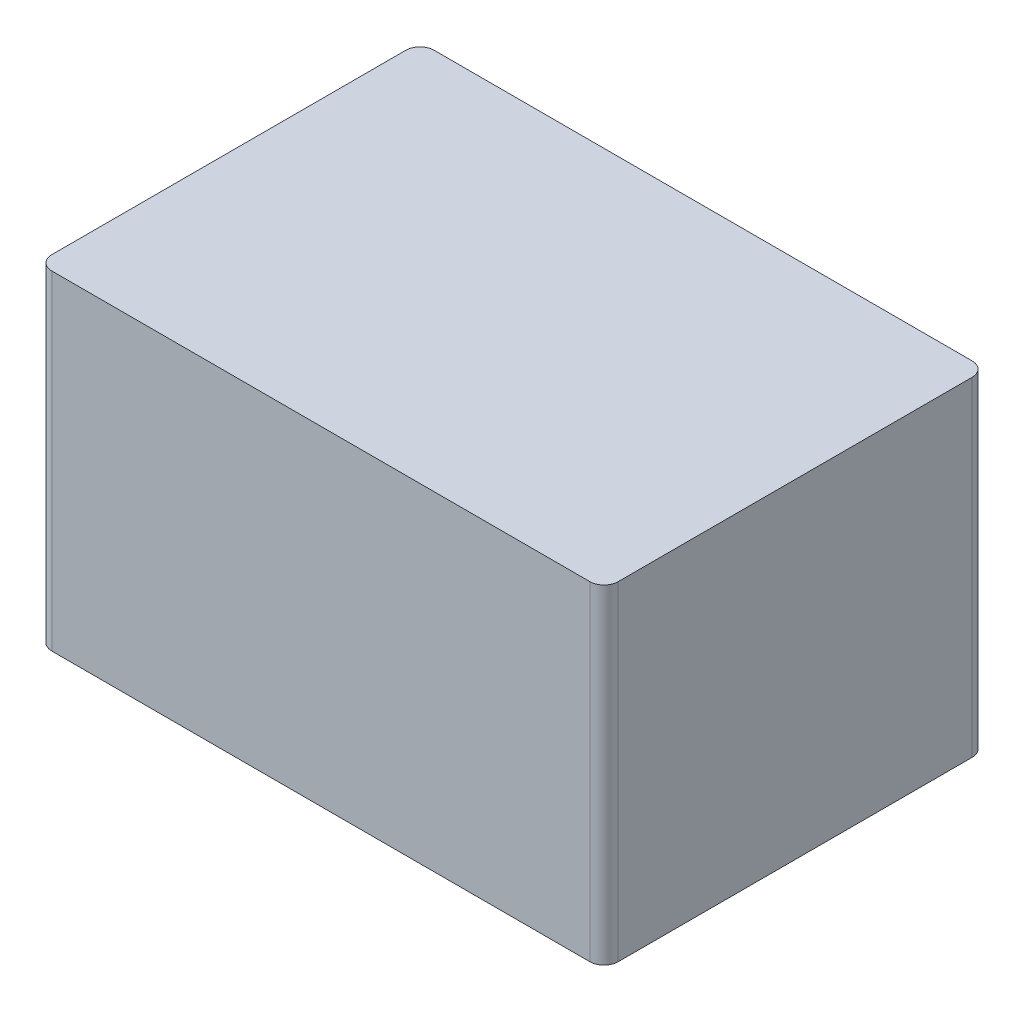
ISO-10303-21;
HEADER;
FILE_DESCRIPTION(('STEP AP214'),'2;1');
FILE_NAME('part.step','',(''),(''),'','','');
FILE_SCHEMA(('AUTOMOTIVE_DESIGN { 1 0 10303 214 1 1 1 1 }'));
ENDSEC;
DATA;
#1=APPLICATION_CONTEXT('core data for automotive mechanical design processes');
#2=APPLICATION_PROTOCOL_DEFINITION('international standard','automotive_design',2000,#1);
#3=PRODUCT_CONTEXT('',#1,'mechanical');
#4=PRODUCT('Part','Part','',(#3));
#5=PRODUCT_RELATED_PRODUCT_CATEGORY('part','',(#4));
#6=PRODUCT_DEFINITION_FORMATION('','',#4);
#7=PRODUCT_DEFINITION_CONTEXT('part definition',#1,'design');
#8=PRODUCT_DEFINITION('design','',#6,#7);
#9=PRODUCT_DEFINITION_SHAPE('','',#8);
#10=(LENGTH_UNIT() NAMED_UNIT(*) SI_UNIT(.MILLI.,.METRE.));
#11=(NAMED_UNIT(*) PLANE_ANGLE_UNIT() SI_UNIT($,.RADIAN.));
#12=(NAMED_UNIT(*) SI_UNIT($,.STERADIAN.) SOLID_ANGLE_UNIT());
#13=UNCERTAINTY_MEASURE_WITH_UNIT(LENGTH_MEASURE(1.E-05),#10,'distance_accuracy_value','');
#14=(GEOMETRIC_REPRESENTATION_CONTEXT(3) GLOBAL_UNCERTAINTY_ASSIGNED_CONTEXT((#13)) GLOBAL_UNIT_ASSIGNED_CONTEXT((#10,
#11,#12)) REPRESENTATION_CONTEXT('',''));
#15=CARTESIAN_POINT('',(0.,0.,0.));
#16=DIRECTION('',(0.,0.,1.));
#17=DIRECTION('',(1.,0.,0.));
#18=AXIS2_PLACEMENT_3D('',#15,#16,#17);
#19=CARTESIAN_POINT('',(0.,46.5,0.));
#20=DIRECTION('',(1.,0.,0.));
#21=DIRECTION('',(0.,0.,-1.));
#22=AXIS2_PLACEMENT_3D('',#19,#20,#21);
#23=PLANE('',#22);
#24=DIRECTION('',(0.,0.,1.));
#25=VECTOR('',#24,1.);
#26=CARTESIAN_POINT('',(0.,46.5,0.));
#27=LINE('',#26,#25);
#28=CARTESIAN_POINT('',(0.,46.5,-52.));
#29=VERTEX_POINT('',#28);
#30=CARTESIAN_POINT('',(0.,46.5,-2.));
#31=VERTEX_POINT('',#30);
#32=EDGE_CURVE('E117',#29,#31,#27,.T.);
#33=ORIENTED_EDGE('',*,*,#32,.F.);
#34=DIRECTION('',(0.,-1.,0.));
#35=VECTOR('',#34,1.);
#36=CARTESIAN_POINT('',(0.,46.5,-52.));
#37=LINE('',#36,#35);
#38=CARTESIAN_POINT('',(0.,0.,-52.));
#39=VERTEX_POINT('',#38);
#40=EDGE_CURVE('E102',#29,#39,#37,.T.);
#41=ORIENTED_EDGE('',*,*,#40,.T.);
#42=DIRECTION('',(0.,0.,1.));
#43=VECTOR('',#42,1.);
#44=CARTESIAN_POINT('',(0.,0.,0.));
#45=LINE('',#44,#43);
#46=CARTESIAN_POINT('',(0.,0.,-2.));
#47=VERTEX_POINT('',#46);
#48=EDGE_CURVE('E114',#39,#47,#45,.T.);
#49=ORIENTED_EDGE('',*,*,#48,.T.);
#50=DIRECTION('',(0.,-1.,0.));
#51=VECTOR('',#50,1.);
#52=CARTESIAN_POINT('',(0.,46.5,-2.));
#53=LINE('',#52,#51);
#54=EDGE_CURVE('E119',#47,#31,#53,.F.);
#55=ORIENTED_EDGE('',*,*,#54,.T.);
#56=EDGE_LOOP('',(#33,#41,#49,#55));
#57=FACE_BOUND('',#56,.T.);
#58=ADVANCED_FACE('F33',(#57),#23,.F.);
#59=CARTESIAN_POINT('',(0.,46.5,0.));
#60=DIRECTION('',(0.,0.,-1.));
#61=DIRECTION('',(-1.,0.,0.));
#62=AXIS2_PLACEMENT_3D('',#59,#60,#61);
#63=PLANE('',#62);
#64=DIRECTION('',(1.,0.,0.));
#65=VECTOR('',#64,1.);
#66=CARTESIAN_POINT('',(0.,46.5,0.));
#67=LINE('',#66,#65);
#68=CARTESIAN_POINT('',(2.,46.5,0.));
#69=VERTEX_POINT('',#68);
#70=CARTESIAN_POINT('',(78.,46.5,0.));
#71=VERTEX_POINT('',#70);
#72=EDGE_CURVE('E168',#69,#71,#67,.T.);
#73=ORIENTED_EDGE('',*,*,#72,.F.);
#74=DIRECTION('',(0.,-1.,0.));
#75=VECTOR('',#74,1.);
#76=CARTESIAN_POINT('',(2.,46.5,0.));
#77=LINE('',#76,#75);
#78=CARTESIAN_POINT('',(2.,0.,0.));
#79=VERTEX_POINT('',#78);
#80=EDGE_CURVE('E152',#69,#79,#77,.T.);
#81=ORIENTED_EDGE('',*,*,#80,.T.);
#82=DIRECTION('',(1.,0.,0.));
#83=VECTOR('',#82,1.);
#84=CARTESIAN_POINT('',(0.,0.,0.));
#85=LINE('',#84,#83);
#86=CARTESIAN_POINT('',(78.,0.,0.));
#87=VERTEX_POINT('',#86);
#88=EDGE_CURVE('E123',#79,#87,#85,.T.);
#89=ORIENTED_EDGE('',*,*,#88,.T.);
#90=DIRECTION('',(0.,-1.,0.));
#91=VECTOR('',#90,1.);
#92=CARTESIAN_POINT('',(78.,46.5,0.));
#93=LINE('',#92,#91);
#94=EDGE_CURVE('E150',#87,#71,#93,.F.);
#95=ORIENTED_EDGE('',*,*,#94,.T.);
#96=EDGE_LOOP('',(#73,#81,#89,#95));
#97=FACE_BOUND('',#96,.T.);
#98=ADVANCED_FACE('F178',(#97),#63,.F.);
#99=CARTESIAN_POINT('',(80.,46.5,0.));
#100=DIRECTION('',(-1.,0.,0.));
#101=DIRECTION('',(0.,0.,1.));
#102=AXIS2_PLACEMENT_3D('',#99,#100,#101);
#103=PLANE('',#102);
#104=DIRECTION('',(0.,0.,-1.));
#105=VECTOR('',#104,1.);
#106=CARTESIAN_POINT('',(80.,0.,0.));
#107=LINE('',#106,#105);
#108=CARTESIAN_POINT('',(80.,0.,-2.));
#109=VERTEX_POINT('',#108);
#110=CARTESIAN_POINT('',(80.,0.,-52.));
#111=VERTEX_POINT('',#110);
#112=EDGE_CURVE('E126',#109,#111,#107,.T.);
#113=ORIENTED_EDGE('',*,*,#112,.T.);
#114=DIRECTION('',(0.,-1.,0.));
#115=VECTOR('',#114,1.);
#116=CARTESIAN_POINT('',(80.,46.5,-52.));
#117=LINE('',#116,#115);
#118=CARTESIAN_POINT('',(80.,46.5,-52.));
#119=VERTEX_POINT('',#118);
#120=EDGE_CURVE('E11',#111,#119,#117,.F.);
#121=ORIENTED_EDGE('',*,*,#120,.T.);
#122=DIRECTION('',(0.,0.,-1.));
#123=VECTOR('',#122,1.);
#124=CARTESIAN_POINT('',(80.,46.5,0.));
#125=LINE('',#124,#123);
#126=CARTESIAN_POINT('',(80.,46.5,-2.));
#127=VERTEX_POINT('',#126);
#128=EDGE_CURVE('E158',#127,#119,#125,.T.);
#129=ORIENTED_EDGE('',*,*,#128,.F.);
#130=DIRECTION('',(0.,-1.,0.));
#131=VECTOR('',#130,1.);
#132=CARTESIAN_POINT('',(80.,46.5,-2.));
#133=LINE('',#132,#131);
#134=EDGE_CURVE('E41',#127,#109,#133,.T.);
#135=ORIENTED_EDGE('',*,*,#134,.T.);
#136=EDGE_LOOP('',(#113,#121,#129,#135));
#137=FACE_BOUND('',#136,.T.);
#138=ADVANCED_FACE('F157',(#137),#103,.F.);
#139=CARTESIAN_POINT('',(0.,46.5,-54.));
#140=DIRECTION('',(0.,0.,1.));
#141=DIRECTION('',(1.,0.,0.));
#142=AXIS2_PLACEMENT_3D('',#139,#140,#141);
#143=PLANE('',#142);
#144=DIRECTION('',(-1.,0.,0.));
#145=VECTOR('',#144,1.);
#146=CARTESIAN_POINT('',(0.,0.,-54.));
#147=LINE('',#146,#145);
#148=CARTESIAN_POINT('',(78.,0.,-54.));
#149=VERTEX_POINT('',#148);
#150=CARTESIAN_POINT('',(2.,0.,-54.));
#151=VERTEX_POINT('',#150);
#152=EDGE_CURVE('E133',#149,#151,#147,.T.);
#153=ORIENTED_EDGE('',*,*,#152,.T.);
#154=DIRECTION('',(0.,-1.,0.));
#155=VECTOR('',#154,1.);
#156=CARTESIAN_POINT('',(2.,46.5,-54.));
#157=LINE('',#156,#155);
#158=CARTESIAN_POINT('',(2.,46.5,-54.));
#159=VERTEX_POINT('',#158);
#160=EDGE_CURVE('E103',#151,#159,#157,.F.);
#161=ORIENTED_EDGE('',*,*,#160,.T.);
#162=DIRECTION('',(-1.,0.,0.));
#163=VECTOR('',#162,1.);
#164=CARTESIAN_POINT('',(0.,46.5,-54.));
#165=LINE('',#164,#163);
#166=CARTESIAN_POINT('',(78.,46.5,-54.));
#167=VERTEX_POINT('',#166);
#168=EDGE_CURVE('E129',#167,#159,#165,.T.);
#169=ORIENTED_EDGE('',*,*,#168,.F.);
#170=DIRECTION('',(0.,-1.,0.));
#171=VECTOR('',#170,1.);
#172=CARTESIAN_POINT('',(78.,46.5,-54.));
#173=LINE('',#172,#171);
#174=EDGE_CURVE('E108',#167,#149,#173,.T.);
#175=ORIENTED_EDGE('',*,*,#174,.T.);
#176=EDGE_LOOP('',(#153,#161,#169,#175));
#177=FACE_BOUND('',#176,.T.);
#178=ADVANCED_FACE('F166',(#177),#143,.F.);
#179=CARTESIAN_POINT('',(0.,46.5,0.));
#180=DIRECTION('',(0.,-1.,0.));
#181=DIRECTION('',(0.,0.,-1.));
#182=AXIS2_PLACEMENT_3D('',#179,#180,#181);
#183=PLANE('',#182);
#184=ORIENTED_EDGE('',*,*,#168,.T.);
#185=CARTESIAN_POINT('',(2.,46.5,-52.));
#186=DIRECTION('',(0.,-1.,0.));
#187=DIRECTION('',(0.,0.,-1.));
#188=AXIS2_PLACEMENT_3D('',#185,#186,#187);
#189=CIRCLE('',#188,2.);
#190=EDGE_CURVE('E148',#159,#29,#189,.F.);
#191=ORIENTED_EDGE('',*,*,#190,.T.);
#192=ORIENTED_EDGE('',*,*,#32,.T.);
#193=CARTESIAN_POINT('',(2.,46.5,-2.));
#194=DIRECTION('',(0.,-1.,0.));
#195=DIRECTION('',(0.,0.,-1.));
#196=AXIS2_PLACEMENT_3D('',#193,#194,#195);
#197=CIRCLE('',#196,2.);
#198=EDGE_CURVE('E146',#31,#69,#197,.F.);
#199=ORIENTED_EDGE('',*,*,#198,.T.);
#200=ORIENTED_EDGE('',*,*,#72,.T.);
#201=CARTESIAN_POINT('',(78.,46.5,-2.));
#202=DIRECTION('',(0.,-1.,0.));
#203=DIRECTION('',(0.,0.,-1.));
#204=AXIS2_PLACEMENT_3D('',#201,#202,#203);
#205=CIRCLE('',#204,2.);
#206=EDGE_CURVE('E53',#71,#127,#205,.F.);
#207=ORIENTED_EDGE('',*,*,#206,.T.);
#208=ORIENTED_EDGE('',*,*,#128,.T.);
#209=CARTESIAN_POINT('',(78.,46.5,-52.));
#210=DIRECTION('',(0.,-1.,0.));
#211=DIRECTION('',(0.,0.,-1.));
#212=AXIS2_PLACEMENT_3D('',#209,#210,#211);
#213=CIRCLE('',#212,2.);
#214=EDGE_CURVE('E144',#119,#167,#213,.F.);
#215=ORIENTED_EDGE('',*,*,#214,.T.);
#216=EDGE_LOOP('',(#184,#191,#192,#199,#200,#207,#208,#215));
#217=FACE_BOUND('',#216,.T.);
#218=ADVANCED_FACE('F172',(#217),#183,.F.);
#219=CARTESIAN_POINT('',(0.,0.,0.));
#220=DIRECTION('',(0.,-1.,0.));
#221=DIRECTION('',(0.,0.,-1.));
#222=AXIS2_PLACEMENT_3D('',#219,#220,#221);
#223=PLANE('',#222);
#224=ORIENTED_EDGE('',*,*,#48,.F.);
#225=CARTESIAN_POINT('',(2.,0.,-52.));
#226=DIRECTION('',(0.,-1.,0.));
#227=DIRECTION('',(0.,0.,-1.));
#228=AXIS2_PLACEMENT_3D('',#225,#226,#227);
#229=CIRCLE('',#228,2.);
#230=EDGE_CURVE('E98',#39,#151,#229,.T.);
#231=ORIENTED_EDGE('',*,*,#230,.T.);
#232=ORIENTED_EDGE('',*,*,#152,.F.);
#233=CARTESIAN_POINT('',(78.,0.,-52.));
#234=DIRECTION('',(0.,-1.,0.));
#235=DIRECTION('',(0.,0.,-1.));
#236=AXIS2_PLACEMENT_3D('',#233,#234,#235);
#237=CIRCLE('',#236,2.);
#238=EDGE_CURVE('E137',#149,#111,#237,.T.);
#239=ORIENTED_EDGE('',*,*,#238,.T.);
#240=ORIENTED_EDGE('',*,*,#112,.F.);
#241=CARTESIAN_POINT('',(78.,0.,-2.));
#242=DIRECTION('',(0.,-1.,0.));
#243=DIRECTION('',(0.,0.,-1.));
#244=AXIS2_PLACEMENT_3D('',#241,#242,#243);
#245=CIRCLE('',#244,2.);
#246=EDGE_CURVE('E118',#109,#87,#245,.T.);
#247=ORIENTED_EDGE('',*,*,#246,.T.);
#248=ORIENTED_EDGE('',*,*,#88,.F.);
#249=CARTESIAN_POINT('',(2.,0.,-2.));
#250=DIRECTION('',(0.,-1.,0.));
#251=DIRECTION('',(0.,0.,-1.));
#252=AXIS2_PLACEMENT_3D('',#249,#250,#251);
#253=CIRCLE('',#252,2.);
#254=EDGE_CURVE('E109',#79,#47,#253,.T.);
#255=ORIENTED_EDGE('',*,*,#254,.T.);
#256=EDGE_LOOP('',(#224,#231,#232,#239,#240,#247,#248,#255));
#257=FACE_BOUND('',#256,.T.);
#258=ADVANCED_FACE('F121',(#257),#223,.T.);
#259=CARTESIAN_POINT('',(2.,46.5,-52.));
#260=DIRECTION('',(0.,-1.,0.));
#261=DIRECTION('',(0.,0.,-1.));
#262=AXIS2_PLACEMENT_3D('',#259,#260,#261);
#263=CYLINDRICAL_SURFACE('',#262,2.);
#264=ORIENTED_EDGE('',*,*,#190,.F.);
#265=ORIENTED_EDGE('',*,*,#160,.F.);
#266=ORIENTED_EDGE('',*,*,#230,.F.);
#267=ORIENTED_EDGE('',*,*,#40,.F.);
#268=EDGE_LOOP('',(#264,#265,#266,#267));
#269=FACE_BOUND('',#268,.T.);
#270=ADVANCED_FACE('F101',(#269),#263,.T.);
#271=CARTESIAN_POINT('',(2.,46.5,-2.));
#272=DIRECTION('',(0.,-1.,0.));
#273=DIRECTION('',(0.,0.,-1.));
#274=AXIS2_PLACEMENT_3D('',#271,#272,#273);
#275=CYLINDRICAL_SURFACE('',#274,2.);
#276=ORIENTED_EDGE('',*,*,#198,.F.);
#277=ORIENTED_EDGE('',*,*,#54,.F.);
#278=ORIENTED_EDGE('',*,*,#254,.F.);
#279=ORIENTED_EDGE('',*,*,#80,.F.);
#280=EDGE_LOOP('',(#276,#277,#278,#279));
#281=FACE_BOUND('',#280,.T.);
#282=ADVANCED_FACE('F176',(#281),#275,.T.);
#283=CARTESIAN_POINT('',(78.,46.5,-52.));
#284=DIRECTION('',(0.,-1.,0.));
#285=DIRECTION('',(0.,0.,-1.));
#286=AXIS2_PLACEMENT_3D('',#283,#284,#285);
#287=CYLINDRICAL_SURFACE('',#286,2.);
#288=ORIENTED_EDGE('',*,*,#214,.F.);
#289=ORIENTED_EDGE('',*,*,#120,.F.);
#290=ORIENTED_EDGE('',*,*,#238,.F.);
#291=ORIENTED_EDGE('',*,*,#174,.F.);
#292=EDGE_LOOP('',(#288,#289,#290,#291));
#293=FACE_BOUND('',#292,.T.);
#294=ADVANCED_FACE('F163',(#293),#287,.T.);
#295=CARTESIAN_POINT('',(78.,46.5,-2.));
#296=DIRECTION('',(0.,-1.,0.));
#297=DIRECTION('',(0.,0.,-1.));
#298=AXIS2_PLACEMENT_3D('',#295,#296,#297);
#299=CYLINDRICAL_SURFACE('',#298,2.);
#300=ORIENTED_EDGE('',*,*,#206,.F.);
#301=ORIENTED_EDGE('',*,*,#94,.F.);
#302=ORIENTED_EDGE('',*,*,#246,.F.);
#303=ORIENTED_EDGE('',*,*,#134,.F.);
#304=EDGE_LOOP('',(#300,#301,#302,#303));
#305=FACE_BOUND('',#304,.T.);
#306=ADVANCED_FACE('F35',(#305),#299,.T.);
#307=CLOSED_SHELL('',(#58,#98,#138,#178,#218,#258,#270,#282,#294,#306));
#308=MANIFOLD_SOLID_BREP('B2',#307);
#309=ADVANCED_BREP_SHAPE_REPRESENTATION('',(#18,#308),#14);
#310=SHAPE_DEFINITION_REPRESENTATION(#9,#309);
ENDSEC;
END-ISO-10303-21;
